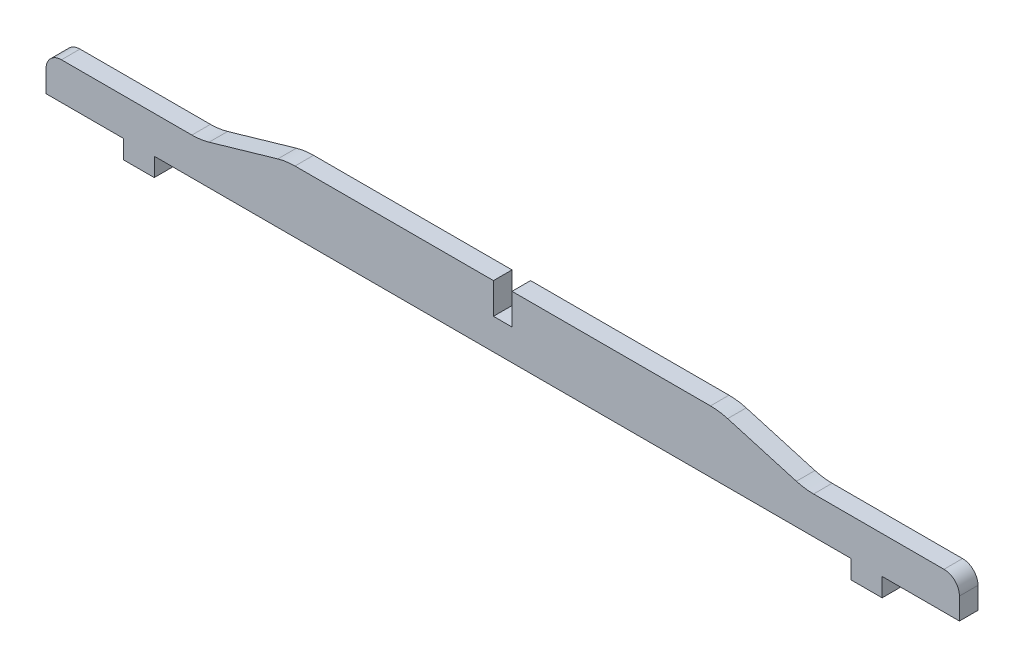
ISO-10303-21;
HEADER;
FILE_DESCRIPTION(('STEP AP214'),'2;1');
FILE_NAME('part.step','',(''),(''),'','','');
FILE_SCHEMA(('AUTOMOTIVE_DESIGN { 1 0 10303 214 1 1 1 1 }'));
ENDSEC;
DATA;
#1=APPLICATION_CONTEXT('core data for automotive mechanical design processes');
#2=APPLICATION_PROTOCOL_DEFINITION('international standard','automotive_design',2000,#1);
#3=PRODUCT_CONTEXT('',#1,'mechanical');
#4=PRODUCT('Part','Part','',(#3));
#5=PRODUCT_RELATED_PRODUCT_CATEGORY('part','',(#4));
#6=PRODUCT_DEFINITION_FORMATION('','',#4);
#7=PRODUCT_DEFINITION_CONTEXT('part definition',#1,'design');
#8=PRODUCT_DEFINITION('design','',#6,#7);
#9=PRODUCT_DEFINITION_SHAPE('','',#8);
#10=(LENGTH_UNIT() NAMED_UNIT(*) SI_UNIT(.MILLI.,.METRE.));
#11=(NAMED_UNIT(*) PLANE_ANGLE_UNIT() SI_UNIT($,.RADIAN.));
#12=(NAMED_UNIT(*) SI_UNIT($,.STERADIAN.) SOLID_ANGLE_UNIT());
#13=UNCERTAINTY_MEASURE_WITH_UNIT(LENGTH_MEASURE(1.E-05),#10,'distance_accuracy_value','');
#14=(GEOMETRIC_REPRESENTATION_CONTEXT(3) GLOBAL_UNCERTAINTY_ASSIGNED_CONTEXT((#13)) GLOBAL_UNIT_ASSIGNED_CONTEXT((#10,
#11,#12)) REPRESENTATION_CONTEXT('',''));
#15=CARTESIAN_POINT('',(0.,0.,0.));
#16=DIRECTION('',(0.,0.,1.));
#17=DIRECTION('',(1.,0.,0.));
#18=AXIS2_PLACEMENT_3D('',#15,#16,#17);
#19=CARTESIAN_POINT('',(70.,0.,6.));
#20=DIRECTION('',(0.,-1.,0.));
#21=DIRECTION('',(0.,0.,-1.));
#22=AXIS2_PLACEMENT_3D('',#19,#20,#21);
#23=PLANE('',#22);
#24=DIRECTION('',(-1.,0.,0.));
#25=VECTOR('',#24,1.);
#26=CARTESIAN_POINT('',(70.,0.,6.));
#27=LINE('',#26,#25);
#28=CARTESIAN_POINT('',(-3.,0.,6.));
#29=VERTEX_POINT('',#28);
#30=CARTESIAN_POINT('',(-67.1664737660185,0.,6.));
#31=VERTEX_POINT('',#30);
#32=EDGE_CURVE('E277',#29,#31,#27,.T.);
#33=ORIENTED_EDGE('',*,*,#32,.F.);
#34=DIRECTION('',(0.,0.,1.));
#35=VECTOR('',#34,1.);
#36=CARTESIAN_POINT('',(-3.,0.,0.));
#37=LINE('',#36,#35);
#38=CARTESIAN_POINT('',(-3.,0.,0.));
#39=VERTEX_POINT('',#38);
#40=EDGE_CURVE('E239',#39,#29,#37,.T.);
#41=ORIENTED_EDGE('',*,*,#40,.F.);
#42=DIRECTION('',(-1.,0.,0.));
#43=VECTOR('',#42,1.);
#44=CARTESIAN_POINT('',(70.,0.,0.));
#45=LINE('',#44,#43);
#46=CARTESIAN_POINT('',(-67.1664737660185,0.,0.));
#47=VERTEX_POINT('',#46);
#48=EDGE_CURVE('E233',#39,#47,#45,.T.);
#49=ORIENTED_EDGE('',*,*,#48,.T.);
#50=DIRECTION('',(0.,0.,-1.));
#51=VECTOR('',#50,1.);
#52=CARTESIAN_POINT('',(-67.1664737660185,0.,6.));
#53=LINE('',#52,#51);
#54=EDGE_CURVE('E442',#47,#31,#53,.F.);
#55=ORIENTED_EDGE('',*,*,#54,.T.);
#56=EDGE_LOOP('',(#33,#41,#49,#55));
#57=FACE_BOUND('',#56,.T.);
#58=ADVANCED_FACE('F38',(#57),#23,.F.);
#59=CARTESIAN_POINT('',(122.66666667,-26.,6.));
#60=DIRECTION('',(-1.,0.,0.));
#61=DIRECTION('',(0.,0.,1.));
#62=AXIS2_PLACEMENT_3D('',#59,#60,#61);
#63=PLANE('',#62);
#64=DIRECTION('',(0.,1.,0.));
#65=VECTOR('',#64,1.);
#66=CARTESIAN_POINT('',(122.66666667,-26.,0.));
#67=LINE('',#66,#65);
#68=CARTESIAN_POINT('',(122.66666667,-26.,0.));
#69=VERTEX_POINT('',#68);
#70=CARTESIAN_POINT('',(122.66666667,-20.,0.));
#71=VERTEX_POINT('',#70);
#72=EDGE_CURVE('E256',#69,#71,#67,.T.);
#73=ORIENTED_EDGE('',*,*,#72,.T.);
#74=DIRECTION('',(0.,0.,-1.));
#75=VECTOR('',#74,1.);
#76=CARTESIAN_POINT('',(122.66666667,-20.,6.));
#77=LINE('',#76,#75);
#78=CARTESIAN_POINT('',(122.66666667,-20.,6.));
#79=VERTEX_POINT('',#78);
#80=EDGE_CURVE('E400',#79,#71,#77,.T.);
#81=ORIENTED_EDGE('',*,*,#80,.F.);
#82=DIRECTION('',(0.,1.,0.));
#83=VECTOR('',#82,1.);
#84=CARTESIAN_POINT('',(122.66666667,-26.,6.));
#85=LINE('',#84,#83);
#86=CARTESIAN_POINT('',(122.66666667,-26.,6.));
#87=VERTEX_POINT('',#86);
#88=EDGE_CURVE('E257',#87,#79,#85,.T.);
#89=ORIENTED_EDGE('',*,*,#88,.F.);
#90=DIRECTION('',(0.,0.,-1.));
#91=VECTOR('',#90,1.);
#92=CARTESIAN_POINT('',(122.66666667,-26.,6.));
#93=LINE('',#92,#91);
#94=EDGE_CURVE('E312',#87,#69,#93,.T.);
#95=ORIENTED_EDGE('',*,*,#94,.T.);
#96=EDGE_LOOP('',(#73,#81,#89,#95));
#97=FACE_BOUND('',#96,.T.);
#98=ADVANCED_FACE('F540',(#97),#63,.F.);
#99=CARTESIAN_POINT('',(147.66666667,-20.,6.));
#100=DIRECTION('',(0.,1.,0.));
#101=DIRECTION('',(0.,0.,1.));
#102=AXIS2_PLACEMENT_3D('',#99,#100,#101);
#103=PLANE('',#102);
#104=DIRECTION('',(1.,0.,0.));
#105=VECTOR('',#104,1.);
#106=CARTESIAN_POINT('',(147.66666667,-20.,0.));
#107=LINE('',#106,#105);
#108=CARTESIAN_POINT('',(147.66666667,-20.,0.));
#109=VERTEX_POINT('',#108);
#110=EDGE_CURVE('E316',#71,#109,#107,.T.);
#111=ORIENTED_EDGE('',*,*,#110,.T.);
#112=DIRECTION('',(0.,0.,-1.));
#113=VECTOR('',#112,1.);
#114=CARTESIAN_POINT('',(147.66666667,-20.,6.));
#115=LINE('',#114,#113);
#116=CARTESIAN_POINT('',(147.66666667,-20.,6.));
#117=VERTEX_POINT('',#116);
#118=EDGE_CURVE('E396',#117,#109,#115,.T.);
#119=ORIENTED_EDGE('',*,*,#118,.F.);
#120=DIRECTION('',(1.,0.,0.));
#121=VECTOR('',#120,1.);
#122=CARTESIAN_POINT('',(147.66666667,-20.,6.));
#123=LINE('',#122,#121);
#124=EDGE_CURVE('E261',#79,#117,#123,.T.);
#125=ORIENTED_EDGE('',*,*,#124,.F.);
#126=ORIENTED_EDGE('',*,*,#80,.T.);
#127=EDGE_LOOP('',(#111,#119,#125,#126));
#128=FACE_BOUND('',#127,.T.);
#129=ADVANCED_FACE('F543',(#128),#103,.F.);
#130=CARTESIAN_POINT('',(147.66666667,-8.00000000000002,6.));
#131=DIRECTION('',(-1.,0.,0.));
#132=DIRECTION('',(0.,-1.,0.));
#133=AXIS2_PLACEMENT_3D('',#130,#131,#132);
#134=PLANE('',#133);
#135=DIRECTION('',(0.,1.,0.));
#136=VECTOR('',#135,1.);
#137=CARTESIAN_POINT('',(147.66666667,-8.00000000000002,0.));
#138=LINE('',#137,#136);
#139=CARTESIAN_POINT('',(147.66666667,-13.,0.));
#140=VERTEX_POINT('',#139);
#141=EDGE_CURVE('E319',#109,#140,#138,.T.);
#142=ORIENTED_EDGE('',*,*,#141,.T.);
#143=DIRECTION('',(0.,0.,-1.));
#144=VECTOR('',#143,1.);
#145=CARTESIAN_POINT('',(147.66666667,-13.,6.));
#146=LINE('',#145,#144);
#147=CARTESIAN_POINT('',(147.66666667,-13.,6.));
#148=VERTEX_POINT('',#147);
#149=EDGE_CURVE('E415',#140,#148,#146,.F.);
#150=ORIENTED_EDGE('',*,*,#149,.T.);
#151=DIRECTION('',(0.,1.,0.));
#152=VECTOR('',#151,1.);
#153=CARTESIAN_POINT('',(147.66666667,-8.00000000000002,6.));
#154=LINE('',#153,#152);
#155=EDGE_CURVE('E265',#117,#148,#154,.T.);
#156=ORIENTED_EDGE('',*,*,#155,.F.);
#157=ORIENTED_EDGE('',*,*,#118,.T.);
#158=EDGE_LOOP('',(#142,#150,#156,#157));
#159=FACE_BOUND('',#158,.T.);
#160=ADVANCED_FACE('F547',(#159),#134,.F.);
#161=CARTESIAN_POINT('',(97.66666667,-8.00000000000002,6.));
#162=DIRECTION('',(0.,-1.,0.));
#163=DIRECTION('',(1.,0.,0.));
#164=AXIS2_PLACEMENT_3D('',#161,#162,#163);
#165=PLANE('',#164);
#166=DIRECTION('',(-1.,0.,0.));
#167=VECTOR('',#166,1.);
#168=CARTESIAN_POINT('',(97.66666667,-8.00000000000002,0.));
#169=LINE('',#168,#167);
#170=CARTESIAN_POINT('',(142.66666667,-8.00000000000002,0.));
#171=VERTEX_POINT('',#170);
#172=CARTESIAN_POINT('',(100.500192903982,-8.00000000000002,0.));
#173=VERTEX_POINT('',#172);
#174=EDGE_CURVE('E323',#171,#173,#169,.T.);
#175=ORIENTED_EDGE('',*,*,#174,.T.);
#176=DIRECTION('',(0.,0.,-1.));
#177=VECTOR('',#176,1.);
#178=CARTESIAN_POINT('',(100.500192903982,-8.00000000000002,6.));
#179=LINE('',#178,#177);
#180=CARTESIAN_POINT('',(100.500192903982,-8.00000000000002,6.));
#181=VERTEX_POINT('',#180);
#182=EDGE_CURVE('E439',#173,#181,#179,.F.);
#183=ORIENTED_EDGE('',*,*,#182,.T.);
#184=DIRECTION('',(-1.,0.,0.));
#185=VECTOR('',#184,1.);
#186=CARTESIAN_POINT('',(97.66666667,-8.00000000000002,6.));
#187=LINE('',#186,#185);
#188=CARTESIAN_POINT('',(142.66666667,-8.00000000000002,6.));
#189=VERTEX_POINT('',#188);
#190=EDGE_CURVE('E269',#189,#181,#187,.T.);
#191=ORIENTED_EDGE('',*,*,#190,.F.);
#192=DIRECTION('',(0.,0.,-1.));
#193=VECTOR('',#192,1.);
#194=CARTESIAN_POINT('',(142.66666667,-8.00000000000002,6.));
#195=LINE('',#194,#193);
#196=EDGE_CURVE('E404',#189,#171,#195,.T.);
#197=ORIENTED_EDGE('',*,*,#196,.T.);
#198=EDGE_LOOP('',(#175,#183,#191,#197));
#199=FACE_BOUND('',#198,.T.);
#200=ADVANCED_FACE('F556',(#199),#165,.F.);
#201=CARTESIAN_POINT('',(70.,0.,6.));
#202=DIRECTION('',(-0.277777033532158,-0.960645574414453,0.));
#203=DIRECTION('',(0.960645574414453,-0.277777033532158,0.));
#204=AXIS2_PLACEMENT_3D('',#201,#202,#203);
#205=PLANE('',#204);
#206=DIRECTION('',(-0.960645574414453,0.277777033532158,0.));
#207=VECTOR('',#206,1.);
#208=CARTESIAN_POINT('',(70.,0.,6.));
#209=LINE('',#208,#207);
#210=CARTESIAN_POINT('',(94.9446522333384,-7.21291148828908,6.));
#211=VERTEX_POINT('',#210);
#212=CARTESIAN_POINT('',(72.7220144366616,-0.787088511710961,6.));
#213=VERTEX_POINT('',#212);
#214=EDGE_CURVE('E273',#211,#213,#209,.T.);
#215=ORIENTED_EDGE('',*,*,#214,.F.);
#216=DIRECTION('',(0.,0.,-1.));
#217=VECTOR('',#216,1.);
#218=CARTESIAN_POINT('',(94.9446522333384,-7.21291148828908,0.));
#219=LINE('',#218,#217);
#220=CARTESIAN_POINT('',(94.9446522333384,-7.21291148828908,0.));
#221=VERTEX_POINT('',#220);
#222=EDGE_CURVE('E435',#211,#221,#219,.T.);
#223=ORIENTED_EDGE('',*,*,#222,.T.);
#224=DIRECTION('',(-0.960645574414453,0.277777033532158,0.));
#225=VECTOR('',#224,1.);
#226=CARTESIAN_POINT('',(70.,0.,0.));
#227=LINE('',#226,#225);
#228=CARTESIAN_POINT('',(72.7220144366616,-0.787088511710961,0.));
#229=VERTEX_POINT('',#228);
#230=EDGE_CURVE('E327',#221,#229,#227,.T.);
#231=ORIENTED_EDGE('',*,*,#230,.T.);
#232=DIRECTION('',(0.,0.,-1.));
#233=VECTOR('',#232,1.);
#234=CARTESIAN_POINT('',(72.7220144366616,-0.787088511710961,6.));
#235=LINE('',#234,#233);
#236=EDGE_CURVE('E432',#229,#213,#235,.F.);
#237=ORIENTED_EDGE('',*,*,#236,.T.);
#238=EDGE_LOOP('',(#215,#223,#231,#237));
#239=FACE_BOUND('',#238,.T.);
#240=ADVANCED_FACE('F565',(#239),#205,.F.);
#241=CARTESIAN_POINT('',(67.1664737660185,0.,0.));
#242=VERTEX_POINT('',#241);
#243=CARTESIAN_POINT('',(3.,0.,0.));
#244=VERTEX_POINT('',#243);
#245=EDGE_CURVE('E331',#242,#244,#45,.T.);
#246=ORIENTED_EDGE('',*,*,#245,.T.);
#247=DIRECTION('',(0.,0.,1.));
#248=VECTOR('',#247,1.);
#249=CARTESIAN_POINT('',(3.,0.,0.));
#250=LINE('',#249,#248);
#251=CARTESIAN_POINT('',(3.,0.,6.));
#252=VERTEX_POINT('',#251);
#253=EDGE_CURVE('E243',#244,#252,#250,.T.);
#254=ORIENTED_EDGE('',*,*,#253,.T.);
#255=CARTESIAN_POINT('',(67.1664737660185,0.,6.));
#256=VERTEX_POINT('',#255);
#257=EDGE_CURVE('E278',#256,#252,#27,.T.);
#258=ORIENTED_EDGE('',*,*,#257,.F.);
#259=DIRECTION('',(0.,0.,-1.));
#260=VECTOR('',#259,1.);
#261=CARTESIAN_POINT('',(67.1664737660185,0.,6.));
#262=LINE('',#261,#260);
#263=EDGE_CURVE('E446',#256,#242,#262,.T.);
#264=ORIENTED_EDGE('',*,*,#263,.T.);
#265=EDGE_LOOP('',(#246,#254,#258,#264));
#266=FACE_BOUND('',#265,.T.);
#267=ADVANCED_FACE('F574',(#266),#23,.F.);
#268=CARTESIAN_POINT('',(-97.66666667,-8.00000000000002,6.));
#269=DIRECTION('',(0.277777033532158,-0.960645574414453,0.));
#270=DIRECTION('',(0.960645574414453,0.277777033532158,0.));
#271=AXIS2_PLACEMENT_3D('',#268,#269,#270);
#272=PLANE('',#271);
#273=DIRECTION('',(-0.960645574414453,-0.277777033532158,0.));
#274=VECTOR('',#273,1.);
#275=CARTESIAN_POINT('',(-97.66666667,-8.00000000000002,6.));
#276=LINE('',#275,#274);
#277=CARTESIAN_POINT('',(-72.7220144366616,-0.787088511710957,6.));
#278=VERTEX_POINT('',#277);
#279=CARTESIAN_POINT('',(-94.9446522333383,-7.21291148828908,6.));
#280=VERTEX_POINT('',#279);
#281=EDGE_CURVE('E282',#278,#280,#276,.T.);
#282=ORIENTED_EDGE('',*,*,#281,.F.);
#283=DIRECTION('',(0.,0.,-1.));
#284=VECTOR('',#283,1.);
#285=CARTESIAN_POINT('',(-72.7220144366616,-0.787088511710958,6.));
#286=LINE('',#285,#284);
#287=CARTESIAN_POINT('',(-72.7220144366616,-0.787088511710957,0.));
#288=VERTEX_POINT('',#287);
#289=EDGE_CURVE('E465',#278,#288,#286,.T.);
#290=ORIENTED_EDGE('',*,*,#289,.T.);
#291=DIRECTION('',(-0.960645574414453,-0.277777033532158,0.));
#292=VECTOR('',#291,1.);
#293=CARTESIAN_POINT('',(-97.66666667,-8.00000000000002,0.));
#294=LINE('',#293,#292);
#295=CARTESIAN_POINT('',(-94.9446522333383,-7.21291148828908,0.));
#296=VERTEX_POINT('',#295);
#297=EDGE_CURVE('E335',#288,#296,#294,.T.);
#298=ORIENTED_EDGE('',*,*,#297,.T.);
#299=DIRECTION('',(0.,0.,-1.));
#300=VECTOR('',#299,1.);
#301=CARTESIAN_POINT('',(-94.9446522333383,-7.21291148828908,6.));
#302=LINE('',#301,#300);
#303=EDGE_CURVE('E462',#296,#280,#302,.F.);
#304=ORIENTED_EDGE('',*,*,#303,.T.);
#305=EDGE_LOOP('',(#282,#290,#298,#304));
#306=FACE_BOUND('',#305,.T.);
#307=ADVANCED_FACE('F486',(#306),#272,.F.);
#308=CARTESIAN_POINT('',(-147.66666667,-8.00000000000002,6.));
#309=DIRECTION('',(0.,-1.,0.));
#310=DIRECTION('',(1.,0.,0.));
#311=AXIS2_PLACEMENT_3D('',#308,#309,#310);
#312=PLANE('',#311);
#313=DIRECTION('',(-1.,0.,0.));
#314=VECTOR('',#313,1.);
#315=CARTESIAN_POINT('',(-147.66666667,-8.00000000000002,6.));
#316=LINE('',#315,#314);
#317=CARTESIAN_POINT('',(-100.500192903981,-8.00000000000002,6.));
#318=VERTEX_POINT('',#317);
#319=CARTESIAN_POINT('',(-142.66666667,-8.00000000000002,6.));
#320=VERTEX_POINT('',#319);
#321=EDGE_CURVE('E285',#318,#320,#316,.T.);
#322=ORIENTED_EDGE('',*,*,#321,.F.);
#323=DIRECTION('',(0.,0.,-1.));
#324=VECTOR('',#323,1.);
#325=CARTESIAN_POINT('',(-100.500192903981,-8.00000000000003,0.));
#326=LINE('',#325,#324);
#327=CARTESIAN_POINT('',(-100.500192903981,-8.00000000000002,0.));
#328=VERTEX_POINT('',#327);
#329=EDGE_CURVE('E469',#318,#328,#326,.T.);
#330=ORIENTED_EDGE('',*,*,#329,.T.);
#331=DIRECTION('',(-1.,0.,0.));
#332=VECTOR('',#331,1.);
#333=CARTESIAN_POINT('',(-147.66666667,-8.00000000000002,0.));
#334=LINE('',#333,#332);
#335=CARTESIAN_POINT('',(-142.66666667,-8.00000000000002,0.));
#336=VERTEX_POINT('',#335);
#337=EDGE_CURVE('E339',#328,#336,#334,.T.);
#338=ORIENTED_EDGE('',*,*,#337,.T.);
#339=DIRECTION('',(0.,0.,-1.));
#340=VECTOR('',#339,1.);
#341=CARTESIAN_POINT('',(-142.66666667,-8.00000000000002,6.));
#342=LINE('',#341,#340);
#343=EDGE_CURVE('E428',#336,#320,#342,.F.);
#344=ORIENTED_EDGE('',*,*,#343,.T.);
#345=EDGE_LOOP('',(#322,#330,#338,#344));
#346=FACE_BOUND('',#345,.T.);
#347=ADVANCED_FACE('F489',(#346),#312,.F.);
#348=CARTESIAN_POINT('',(-147.66666667,-20.,6.));
#349=DIRECTION('',(1.,0.,0.));
#350=DIRECTION('',(0.,1.,0.));
#351=AXIS2_PLACEMENT_3D('',#348,#349,#350);
#352=PLANE('',#351);
#353=DIRECTION('',(0.,-1.,0.));
#354=VECTOR('',#353,1.);
#355=CARTESIAN_POINT('',(-147.66666667,-20.,6.));
#356=LINE('',#355,#354);
#357=CARTESIAN_POINT('',(-147.66666667,-13.,6.));
#358=VERTEX_POINT('',#357);
#359=CARTESIAN_POINT('',(-147.66666667,-20.,6.));
#360=VERTEX_POINT('',#359);
#361=EDGE_CURVE('E288',#358,#360,#356,.T.);
#362=ORIENTED_EDGE('',*,*,#361,.F.);
#363=DIRECTION('',(0.,0.,-1.));
#364=VECTOR('',#363,1.);
#365=CARTESIAN_POINT('',(-147.66666667,-13.,6.));
#366=LINE('',#365,#364);
#367=CARTESIAN_POINT('',(-147.66666667,-13.,0.));
#368=VERTEX_POINT('',#367);
#369=EDGE_CURVE('E424',#358,#368,#366,.T.);
#370=ORIENTED_EDGE('',*,*,#369,.T.);
#371=DIRECTION('',(0.,-1.,0.));
#372=VECTOR('',#371,1.);
#373=CARTESIAN_POINT('',(-147.66666667,-20.,0.));
#374=LINE('',#373,#372);
#375=CARTESIAN_POINT('',(-147.66666667,-20.,0.));
#376=VERTEX_POINT('',#375);
#377=EDGE_CURVE('E342',#368,#376,#374,.T.);
#378=ORIENTED_EDGE('',*,*,#377,.T.);
#379=DIRECTION('',(0.,0.,-1.));
#380=VECTOR('',#379,1.);
#381=CARTESIAN_POINT('',(-147.66666667,-20.,6.));
#382=LINE('',#381,#380);
#383=EDGE_CURVE('E392',#360,#376,#382,.T.);
#384=ORIENTED_EDGE('',*,*,#383,.F.);
#385=EDGE_LOOP('',(#362,#370,#378,#384));
#386=FACE_BOUND('',#385,.T.);
#387=ADVANCED_FACE('F498',(#386),#352,.F.);
#388=CARTESIAN_POINT('',(-147.66666667,-20.,6.));
#389=DIRECTION('',(0.,1.,0.));
#390=DIRECTION('',(0.,0.,1.));
#391=AXIS2_PLACEMENT_3D('',#388,#389,#390);
#392=PLANE('',#391);
#393=DIRECTION('',(1.,0.,0.));
#394=VECTOR('',#393,1.);
#395=CARTESIAN_POINT('',(-147.66666667,-20.,0.));
#396=LINE('',#395,#394);
#397=CARTESIAN_POINT('',(-122.66666667,-20.,0.));
#398=VERTEX_POINT('',#397);
#399=EDGE_CURVE('E345',#376,#398,#396,.T.);
#400=ORIENTED_EDGE('',*,*,#399,.T.);
#401=DIRECTION('',(0.,0.,-1.));
#402=VECTOR('',#401,1.);
#403=CARTESIAN_POINT('',(-122.66666667,-20.,6.));
#404=LINE('',#403,#402);
#405=CARTESIAN_POINT('',(-122.66666667,-20.,6.));
#406=VERTEX_POINT('',#405);
#407=EDGE_CURVE('E388',#406,#398,#404,.T.);
#408=ORIENTED_EDGE('',*,*,#407,.F.);
#409=DIRECTION('',(1.,0.,0.));
#410=VECTOR('',#409,1.);
#411=CARTESIAN_POINT('',(-147.66666667,-20.,6.));
#412=LINE('',#411,#410);
#413=EDGE_CURVE('E291',#360,#406,#412,.T.);
#414=ORIENTED_EDGE('',*,*,#413,.F.);
#415=ORIENTED_EDGE('',*,*,#383,.T.);
#416=EDGE_LOOP('',(#400,#408,#414,#415));
#417=FACE_BOUND('',#416,.T.);
#418=ADVANCED_FACE('F505',(#417),#392,.F.);
#419=CARTESIAN_POINT('',(-122.66666667,-20.,6.));
#420=DIRECTION('',(1.,0.,0.));
#421=DIRECTION('',(0.,0.,-1.));
#422=AXIS2_PLACEMENT_3D('',#419,#420,#421);
#423=PLANE('',#422);
#424=DIRECTION('',(0.,-1.,0.));
#425=VECTOR('',#424,1.);
#426=CARTESIAN_POINT('',(-122.66666667,-20.,0.));
#427=LINE('',#426,#425);
#428=CARTESIAN_POINT('',(-122.66666667,-26.,0.));
#429=VERTEX_POINT('',#428);
#430=EDGE_CURVE('E348',#398,#429,#427,.T.);
#431=ORIENTED_EDGE('',*,*,#430,.T.);
#432=DIRECTION('',(0.,0.,-1.));
#433=VECTOR('',#432,1.);
#434=CARTESIAN_POINT('',(-122.66666667,-26.,6.));
#435=LINE('',#434,#433);
#436=CARTESIAN_POINT('',(-122.66666667,-26.,6.));
#437=VERTEX_POINT('',#436);
#438=EDGE_CURVE('E384',#437,#429,#435,.T.);
#439=ORIENTED_EDGE('',*,*,#438,.F.);
#440=DIRECTION('',(0.,-1.,0.));
#441=VECTOR('',#440,1.);
#442=CARTESIAN_POINT('',(-122.66666667,-20.,6.));
#443=LINE('',#442,#441);
#444=EDGE_CURVE('E294',#406,#437,#443,.T.);
#445=ORIENTED_EDGE('',*,*,#444,.F.);
#446=ORIENTED_EDGE('',*,*,#407,.T.);
#447=EDGE_LOOP('',(#431,#439,#445,#446));
#448=FACE_BOUND('',#447,.T.);
#449=ADVANCED_FACE('F512',(#448),#423,.F.);
#450=CARTESIAN_POINT('',(-122.66666667,-26.,6.));
#451=DIRECTION('',(0.,1.,0.));
#452=DIRECTION('',(0.,0.,1.));
#453=AXIS2_PLACEMENT_3D('',#450,#451,#452);
#454=PLANE('',#453);
#455=DIRECTION('',(1.,0.,0.));
#456=VECTOR('',#455,1.);
#457=CARTESIAN_POINT('',(-122.66666667,-26.,0.));
#458=LINE('',#457,#456);
#459=CARTESIAN_POINT('',(-112.66666667,-26.,0.));
#460=VERTEX_POINT('',#459);
#461=EDGE_CURVE('E351',#429,#460,#458,.T.);
#462=ORIENTED_EDGE('',*,*,#461,.T.);
#463=DIRECTION('',(0.,0.,-1.));
#464=VECTOR('',#463,1.);
#465=CARTESIAN_POINT('',(-112.66666667,-26.,6.));
#466=LINE('',#465,#464);
#467=CARTESIAN_POINT('',(-112.66666667,-26.,6.));
#468=VERTEX_POINT('',#467);
#469=EDGE_CURVE('E380',#468,#460,#466,.T.);
#470=ORIENTED_EDGE('',*,*,#469,.F.);
#471=DIRECTION('',(1.,0.,0.));
#472=VECTOR('',#471,1.);
#473=CARTESIAN_POINT('',(-122.66666667,-26.,6.));
#474=LINE('',#473,#472);
#475=EDGE_CURVE('E297',#437,#468,#474,.T.);
#476=ORIENTED_EDGE('',*,*,#475,.F.);
#477=ORIENTED_EDGE('',*,*,#438,.T.);
#478=EDGE_LOOP('',(#462,#470,#476,#477));
#479=FACE_BOUND('',#478,.T.);
#480=ADVANCED_FACE('F515',(#479),#454,.F.);
#481=CARTESIAN_POINT('',(-112.66666667,-26.,6.));
#482=DIRECTION('',(-1.,0.,0.));
#483=DIRECTION('',(0.,0.,1.));
#484=AXIS2_PLACEMENT_3D('',#481,#482,#483);
#485=PLANE('',#484);
#486=DIRECTION('',(0.,1.,0.));
#487=VECTOR('',#486,1.);
#488=CARTESIAN_POINT('',(-112.66666667,-26.,0.));
#489=LINE('',#488,#487);
#490=CARTESIAN_POINT('',(-112.66666667,-20.,0.));
#491=VERTEX_POINT('',#490);
#492=EDGE_CURVE('E354',#460,#491,#489,.T.);
#493=ORIENTED_EDGE('',*,*,#492,.T.);
#494=DIRECTION('',(0.,0.,-1.));
#495=VECTOR('',#494,1.);
#496=CARTESIAN_POINT('',(-112.66666667,-20.,6.));
#497=LINE('',#496,#495);
#498=CARTESIAN_POINT('',(-112.66666667,-20.,6.));
#499=VERTEX_POINT('',#498);
#500=EDGE_CURVE('E376',#499,#491,#497,.T.);
#501=ORIENTED_EDGE('',*,*,#500,.F.);
#502=DIRECTION('',(0.,1.,0.));
#503=VECTOR('',#502,1.);
#504=CARTESIAN_POINT('',(-112.66666667,-26.,6.));
#505=LINE('',#504,#503);
#506=EDGE_CURVE('E300',#468,#499,#505,.T.);
#507=ORIENTED_EDGE('',*,*,#506,.F.);
#508=ORIENTED_EDGE('',*,*,#469,.T.);
#509=EDGE_LOOP('',(#493,#501,#507,#508));
#510=FACE_BOUND('',#509,.T.);
#511=ADVANCED_FACE('F520',(#510),#485,.F.);
#512=CARTESIAN_POINT('',(112.66666667,-20.,6.));
#513=DIRECTION('',(0.,1.,0.));
#514=DIRECTION('',(0.,0.,1.));
#515=AXIS2_PLACEMENT_3D('',#512,#513,#514);
#516=PLANE('',#515);
#517=DIRECTION('',(1.,0.,0.));
#518=VECTOR('',#517,1.);
#519=CARTESIAN_POINT('',(112.66666667,-20.,0.));
#520=LINE('',#519,#518);
#521=CARTESIAN_POINT('',(112.66666667,-20.,0.));
#522=VERTEX_POINT('',#521);
#523=EDGE_CURVE('E357',#491,#522,#520,.T.);
#524=ORIENTED_EDGE('',*,*,#523,.T.);
#525=DIRECTION('',(0.,0.,-1.));
#526=VECTOR('',#525,1.);
#527=CARTESIAN_POINT('',(112.66666667,-20.,6.));
#528=LINE('',#527,#526);
#529=CARTESIAN_POINT('',(112.66666667,-20.,6.));
#530=VERTEX_POINT('',#529);
#531=EDGE_CURVE('E372',#530,#522,#528,.T.);
#532=ORIENTED_EDGE('',*,*,#531,.F.);
#533=DIRECTION('',(1.,0.,0.));
#534=VECTOR('',#533,1.);
#535=CARTESIAN_POINT('',(112.66666667,-20.,6.));
#536=LINE('',#535,#534);
#537=EDGE_CURVE('E303',#499,#530,#536,.T.);
#538=ORIENTED_EDGE('',*,*,#537,.F.);
#539=ORIENTED_EDGE('',*,*,#500,.T.);
#540=EDGE_LOOP('',(#524,#532,#538,#539));
#541=FACE_BOUND('',#540,.T.);
#542=ADVANCED_FACE('F526',(#541),#516,.F.);
#543=CARTESIAN_POINT('',(112.66666667,-20.,6.));
#544=DIRECTION('',(1.,0.,0.));
#545=DIRECTION('',(0.,0.,-1.));
#546=AXIS2_PLACEMENT_3D('',#543,#544,#545);
#547=PLANE('',#546);
#548=DIRECTION('',(0.,-1.,0.));
#549=VECTOR('',#548,1.);
#550=CARTESIAN_POINT('',(112.66666667,-20.,0.));
#551=LINE('',#550,#549);
#552=CARTESIAN_POINT('',(112.66666667,-26.,0.));
#553=VERTEX_POINT('',#552);
#554=EDGE_CURVE('E360',#522,#553,#551,.T.);
#555=ORIENTED_EDGE('',*,*,#554,.T.);
#556=DIRECTION('',(0.,0.,-1.));
#557=VECTOR('',#556,1.);
#558=CARTESIAN_POINT('',(112.66666667,-26.,6.));
#559=LINE('',#558,#557);
#560=CARTESIAN_POINT('',(112.66666667,-26.,6.));
#561=VERTEX_POINT('',#560);
#562=EDGE_CURVE('E368',#561,#553,#559,.T.);
#563=ORIENTED_EDGE('',*,*,#562,.F.);
#564=DIRECTION('',(0.,-1.,0.));
#565=VECTOR('',#564,1.);
#566=CARTESIAN_POINT('',(112.66666667,-20.,6.));
#567=LINE('',#566,#565);
#568=EDGE_CURVE('E306',#530,#561,#567,.T.);
#569=ORIENTED_EDGE('',*,*,#568,.F.);
#570=ORIENTED_EDGE('',*,*,#531,.T.);
#571=EDGE_LOOP('',(#555,#563,#569,#570));
#572=FACE_BOUND('',#571,.T.);
#573=ADVANCED_FACE('F530',(#572),#547,.F.);
#574=CARTESIAN_POINT('',(112.66666667,-26.,6.));
#575=DIRECTION('',(0.,1.,0.));
#576=DIRECTION('',(0.,0.,1.));
#577=AXIS2_PLACEMENT_3D('',#574,#575,#576);
#578=PLANE('',#577);
#579=DIRECTION('',(1.,0.,0.));
#580=VECTOR('',#579,1.);
#581=CARTESIAN_POINT('',(112.66666667,-26.,0.));
#582=LINE('',#581,#580);
#583=EDGE_CURVE('E262',#553,#69,#582,.T.);
#584=ORIENTED_EDGE('',*,*,#583,.T.);
#585=ORIENTED_EDGE('',*,*,#94,.F.);
#586=DIRECTION('',(1.,0.,0.));
#587=VECTOR('',#586,1.);
#588=CARTESIAN_POINT('',(112.66666667,-26.,6.));
#589=LINE('',#588,#587);
#590=EDGE_CURVE('E309',#561,#87,#589,.T.);
#591=ORIENTED_EDGE('',*,*,#590,.F.);
#592=ORIENTED_EDGE('',*,*,#562,.T.);
#593=EDGE_LOOP('',(#584,#585,#591,#592));
#594=FACE_BOUND('',#593,.T.);
#595=ADVANCED_FACE('F535',(#594),#578,.F.);
#596=CARTESIAN_POINT('',(0.,0.,6.));
#597=DIRECTION('',(0.,0.,1.));
#598=DIRECTION('',(1.,0.,0.));
#599=AXIS2_PLACEMENT_3D('',#596,#597,#598);
#600=PLANE('',#599);
#601=DIRECTION('',(0.,-1.,0.));
#602=VECTOR('',#601,1.);
#603=CARTESIAN_POINT('',(-3.,0.,6.));
#604=LINE('',#603,#602);
#605=CARTESIAN_POINT('',(-3.,-10.,6.));
#606=VERTEX_POINT('',#605);
#607=EDGE_CURVE('E218',#29,#606,#604,.T.);
#608=ORIENTED_EDGE('',*,*,#607,.F.);
#609=ORIENTED_EDGE('',*,*,#32,.T.);
#610=CARTESIAN_POINT('',(-67.1664737660185,-20.,6.));
#611=DIRECTION('',(0.,0.,1.));
#612=DIRECTION('',(1.,0.,0.));
#613=AXIS2_PLACEMENT_3D('',#610,#611,#612);
#614=CIRCLE('',#613,20.);
#615=EDGE_CURVE('E456',#31,#278,#614,.T.);
#616=ORIENTED_EDGE('',*,*,#615,.T.);
#617=ORIENTED_EDGE('',*,*,#281,.T.);
#618=CARTESIAN_POINT('',(-100.500192903981,12.,6.));
#619=DIRECTION('',(0.,0.,1.));
#620=DIRECTION('',(1.,0.,0.));
#621=AXIS2_PLACEMENT_3D('',#618,#619,#620);
#622=CIRCLE('',#621,20.);
#623=EDGE_CURVE('E11',#280,#318,#622,.F.);
#624=ORIENTED_EDGE('',*,*,#623,.T.);
#625=ORIENTED_EDGE('',*,*,#321,.T.);
#626=CARTESIAN_POINT('',(-142.66666667,-13.,6.));
#627=DIRECTION('',(0.,0.,1.));
#628=DIRECTION('',(1.,0.,0.));
#629=AXIS2_PLACEMENT_3D('',#626,#627,#628);
#630=CIRCLE('',#629,5.);
#631=EDGE_CURVE('E418',#320,#358,#630,.T.);
#632=ORIENTED_EDGE('',*,*,#631,.T.);
#633=ORIENTED_EDGE('',*,*,#361,.T.);
#634=ORIENTED_EDGE('',*,*,#413,.T.);
#635=ORIENTED_EDGE('',*,*,#444,.T.);
#636=ORIENTED_EDGE('',*,*,#475,.T.);
#637=ORIENTED_EDGE('',*,*,#506,.T.);
#638=ORIENTED_EDGE('',*,*,#537,.T.);
#639=ORIENTED_EDGE('',*,*,#568,.T.);
#640=ORIENTED_EDGE('',*,*,#590,.T.);
#641=ORIENTED_EDGE('',*,*,#88,.T.);
#642=ORIENTED_EDGE('',*,*,#124,.T.);
#643=ORIENTED_EDGE('',*,*,#155,.T.);
#644=CARTESIAN_POINT('',(142.66666667,-13.,6.));
#645=DIRECTION('',(0.,0.,1.));
#646=DIRECTION('',(1.,0.,0.));
#647=AXIS2_PLACEMENT_3D('',#644,#645,#646);
#648=CIRCLE('',#647,5.);
#649=EDGE_CURVE('E421',#148,#189,#648,.T.);
#650=ORIENTED_EDGE('',*,*,#649,.T.);
#651=ORIENTED_EDGE('',*,*,#190,.T.);
#652=CARTESIAN_POINT('',(100.500192903982,12.,6.));
#653=DIRECTION('',(0.,0.,1.));
#654=DIRECTION('',(1.,0.,0.));
#655=AXIS2_PLACEMENT_3D('',#652,#653,#654);
#656=CIRCLE('',#655,20.);
#657=EDGE_CURVE('E476',#181,#211,#656,.F.);
#658=ORIENTED_EDGE('',*,*,#657,.T.);
#659=ORIENTED_EDGE('',*,*,#214,.T.);
#660=CARTESIAN_POINT('',(67.1664737660185,-20.,6.));
#661=DIRECTION('',(0.,0.,1.));
#662=DIRECTION('',(1.,0.,0.));
#663=AXIS2_PLACEMENT_3D('',#660,#661,#662);
#664=CIRCLE('',#663,20.);
#665=EDGE_CURVE('E459',#213,#256,#664,.T.);
#666=ORIENTED_EDGE('',*,*,#665,.T.);
#667=ORIENTED_EDGE('',*,*,#257,.T.);
#668=DIRECTION('',(0.,1.,0.));
#669=VECTOR('',#668,1.);
#670=CARTESIAN_POINT('',(3.,0.,6.));
#671=LINE('',#670,#669);
#672=CARTESIAN_POINT('',(3.,-10.,6.));
#673=VERTEX_POINT('',#672);
#674=EDGE_CURVE('E251',#673,#252,#671,.T.);
#675=ORIENTED_EDGE('',*,*,#674,.F.);
#676=DIRECTION('',(1.,0.,0.));
#677=VECTOR('',#676,1.);
#678=CARTESIAN_POINT('',(0.,-10.,6.));
#679=LINE('',#678,#677);
#680=EDGE_CURVE('E242',#606,#673,#679,.T.);
#681=ORIENTED_EDGE('',*,*,#680,.F.);
#682=EDGE_LOOP('',(#608,#609,#616,#617,#624,#625,#632,#633,#634,#635,#636,#637,#638,#639,#640,
#641,#642,#643,#650,#651,#658,#659,#666,#667,#675,#681));
#683=FACE_BOUND('',#682,.T.);
#684=ADVANCED_FACE('F492',(#683),#600,.T.);
#685=CARTESIAN_POINT('',(0.,0.,0.));
#686=DIRECTION('',(0.,0.,1.));
#687=DIRECTION('',(1.,0.,0.));
#688=AXIS2_PLACEMENT_3D('',#685,#686,#687);
#689=PLANE('',#688);
#690=ORIENTED_EDGE('',*,*,#48,.F.);
#691=DIRECTION('',(0.,-1.,0.));
#692=VECTOR('',#691,1.);
#693=CARTESIAN_POINT('',(-3.,-10.,0.));
#694=LINE('',#693,#692);
#695=CARTESIAN_POINT('',(-3.,-10.,0.));
#696=VERTEX_POINT('',#695);
#697=EDGE_CURVE('E215',#39,#696,#694,.T.);
#698=ORIENTED_EDGE('',*,*,#697,.T.);
#699=DIRECTION('',(1.,0.,0.));
#700=VECTOR('',#699,1.);
#701=CARTESIAN_POINT('',(-3.,-10.,0.));
#702=LINE('',#701,#700);
#703=CARTESIAN_POINT('',(3.,-10.,0.));
#704=VERTEX_POINT('',#703);
#705=EDGE_CURVE('E225',#696,#704,#702,.T.);
#706=ORIENTED_EDGE('',*,*,#705,.T.);
#707=DIRECTION('',(0.,1.,0.));
#708=VECTOR('',#707,1.);
#709=CARTESIAN_POINT('',(3.,-10.,0.));
#710=LINE('',#709,#708);
#711=EDGE_CURVE('E54',#704,#244,#710,.T.);
#712=ORIENTED_EDGE('',*,*,#711,.T.);
#713=ORIENTED_EDGE('',*,*,#245,.F.);
#714=CARTESIAN_POINT('',(67.1664737660185,-20.,0.));
#715=DIRECTION('',(0.,0.,1.));
#716=DIRECTION('',(1.,0.,0.));
#717=AXIS2_PLACEMENT_3D('',#714,#715,#716);
#718=CIRCLE('',#717,20.);
#719=EDGE_CURVE('E453',#242,#229,#718,.F.);
#720=ORIENTED_EDGE('',*,*,#719,.T.);
#721=ORIENTED_EDGE('',*,*,#230,.F.);
#722=CARTESIAN_POINT('',(100.500192903982,12.,0.));
#723=DIRECTION('',(0.,0.,1.));
#724=DIRECTION('',(1.,0.,0.));
#725=AXIS2_PLACEMENT_3D('',#722,#723,#724);
#726=CIRCLE('',#725,20.);
#727=EDGE_CURVE('E473',#221,#173,#726,.T.);
#728=ORIENTED_EDGE('',*,*,#727,.T.);
#729=ORIENTED_EDGE('',*,*,#174,.F.);
#730=CARTESIAN_POINT('',(142.66666667,-13.,0.));
#731=DIRECTION('',(0.,0.,1.));
#732=DIRECTION('',(1.,0.,0.));
#733=AXIS2_PLACEMENT_3D('',#730,#731,#732);
#734=CIRCLE('',#733,5.);
#735=EDGE_CURVE('E412',#171,#140,#734,.F.);
#736=ORIENTED_EDGE('',*,*,#735,.T.);
#737=ORIENTED_EDGE('',*,*,#141,.F.);
#738=ORIENTED_EDGE('',*,*,#110,.F.);
#739=ORIENTED_EDGE('',*,*,#72,.F.);
#740=ORIENTED_EDGE('',*,*,#583,.F.);
#741=ORIENTED_EDGE('',*,*,#554,.F.);
#742=ORIENTED_EDGE('',*,*,#523,.F.);
#743=ORIENTED_EDGE('',*,*,#492,.F.);
#744=ORIENTED_EDGE('',*,*,#461,.F.);
#745=ORIENTED_EDGE('',*,*,#430,.F.);
#746=ORIENTED_EDGE('',*,*,#399,.F.);
#747=ORIENTED_EDGE('',*,*,#377,.F.);
#748=CARTESIAN_POINT('',(-142.66666667,-13.,0.));
#749=DIRECTION('',(0.,0.,1.));
#750=DIRECTION('',(1.,0.,0.));
#751=AXIS2_PLACEMENT_3D('',#748,#749,#750);
#752=CIRCLE('',#751,5.);
#753=EDGE_CURVE('E408',#368,#336,#752,.F.);
#754=ORIENTED_EDGE('',*,*,#753,.T.);
#755=ORIENTED_EDGE('',*,*,#337,.F.);
#756=CARTESIAN_POINT('',(-100.500192903981,12.,0.));
#757=DIRECTION('',(0.,0.,1.));
#758=DIRECTION('',(1.,0.,0.));
#759=AXIS2_PLACEMENT_3D('',#756,#757,#758);
#760=CIRCLE('',#759,20.);
#761=EDGE_CURVE('E47',#328,#296,#760,.T.);
#762=ORIENTED_EDGE('',*,*,#761,.T.);
#763=ORIENTED_EDGE('',*,*,#297,.F.);
#764=CARTESIAN_POINT('',(-67.1664737660185,-20.,0.));
#765=DIRECTION('',(0.,0.,1.));
#766=DIRECTION('',(1.,0.,0.));
#767=AXIS2_PLACEMENT_3D('',#764,#765,#766);
#768=CIRCLE('',#767,20.);
#769=EDGE_CURVE('E450',#288,#47,#768,.F.);
#770=ORIENTED_EDGE('',*,*,#769,.T.);
#771=EDGE_LOOP('',(#690,#698,#706,#712,#713,#720,#721,#728,#729,#736,#737,#738,#739,#740,#741,
#742,#743,#744,#745,#746,#747,#754,#755,#762,#763,#770));
#772=FACE_BOUND('',#771,.T.);
#773=ADVANCED_FACE('F231',(#772),#689,.F.);
#774=CARTESIAN_POINT('',(142.66666667,-13.,6.));
#775=DIRECTION('',(0.,0.,-1.));
#776=DIRECTION('',(-1.,0.,0.));
#777=AXIS2_PLACEMENT_3D('',#774,#775,#776);
#778=CYLINDRICAL_SURFACE('',#777,5.);
#779=ORIENTED_EDGE('',*,*,#649,.F.);
#780=ORIENTED_EDGE('',*,*,#149,.F.);
#781=ORIENTED_EDGE('',*,*,#735,.F.);
#782=ORIENTED_EDGE('',*,*,#196,.F.);
#783=EDGE_LOOP('',(#779,#780,#781,#782));
#784=FACE_BOUND('',#783,.T.);
#785=ADVANCED_FACE('F553',(#784),#778,.T.);
#786=CARTESIAN_POINT('',(-142.66666667,-13.,6.));
#787=DIRECTION('',(0.,0.,-1.));
#788=DIRECTION('',(-1.,0.,0.));
#789=AXIS2_PLACEMENT_3D('',#786,#787,#788);
#790=CYLINDRICAL_SURFACE('',#789,5.);
#791=ORIENTED_EDGE('',*,*,#631,.F.);
#792=ORIENTED_EDGE('',*,*,#343,.F.);
#793=ORIENTED_EDGE('',*,*,#753,.F.);
#794=ORIENTED_EDGE('',*,*,#369,.F.);
#795=EDGE_LOOP('',(#791,#792,#793,#794));
#796=FACE_BOUND('',#795,.T.);
#797=ADVANCED_FACE('F501',(#796),#790,.T.);
#798=CARTESIAN_POINT('',(100.500192903982,12.,6.));
#799=DIRECTION('',(0.,0.,1.));
#800=DIRECTION('',(1.,0.,0.));
#801=AXIS2_PLACEMENT_3D('',#798,#799,#800);
#802=CYLINDRICAL_SURFACE('',#801,20.);
#803=ORIENTED_EDGE('',*,*,#657,.F.);
#804=ORIENTED_EDGE('',*,*,#182,.F.);
#805=ORIENTED_EDGE('',*,*,#727,.F.);
#806=ORIENTED_EDGE('',*,*,#222,.F.);
#807=EDGE_LOOP('',(#803,#804,#805,#806));
#808=FACE_BOUND('',#807,.T.);
#809=ADVANCED_FACE('F562',(#808),#802,.F.);
#810=CARTESIAN_POINT('',(67.1664737660185,-20.,6.));
#811=DIRECTION('',(0.,0.,-1.));
#812=DIRECTION('',(-1.,0.,0.));
#813=AXIS2_PLACEMENT_3D('',#810,#811,#812);
#814=CYLINDRICAL_SURFACE('',#813,20.);
#815=ORIENTED_EDGE('',*,*,#665,.F.);
#816=ORIENTED_EDGE('',*,*,#236,.F.);
#817=ORIENTED_EDGE('',*,*,#719,.F.);
#818=ORIENTED_EDGE('',*,*,#263,.F.);
#819=EDGE_LOOP('',(#815,#816,#817,#818));
#820=FACE_BOUND('',#819,.T.);
#821=ADVANCED_FACE('F571',(#820),#814,.T.);
#822=CARTESIAN_POINT('',(-67.1664737660185,-20.,6.));
#823=DIRECTION('',(0.,0.,-1.));
#824=DIRECTION('',(-1.,0.,0.));
#825=AXIS2_PLACEMENT_3D('',#822,#823,#824);
#826=CYLINDRICAL_SURFACE('',#825,20.);
#827=ORIENTED_EDGE('',*,*,#615,.F.);
#828=ORIENTED_EDGE('',*,*,#54,.F.);
#829=ORIENTED_EDGE('',*,*,#769,.F.);
#830=ORIENTED_EDGE('',*,*,#289,.F.);
#831=EDGE_LOOP('',(#827,#828,#829,#830));
#832=FACE_BOUND('',#831,.T.);
#833=ADVANCED_FACE('F618',(#832),#826,.T.);
#834=CARTESIAN_POINT('',(-100.500192903981,12.,6.));
#835=DIRECTION('',(0.,0.,1.));
#836=DIRECTION('',(1.,0.,0.));
#837=AXIS2_PLACEMENT_3D('',#834,#835,#836);
#838=CYLINDRICAL_SURFACE('',#837,20.);
#839=ORIENTED_EDGE('',*,*,#623,.F.);
#840=ORIENTED_EDGE('',*,*,#303,.F.);
#841=ORIENTED_EDGE('',*,*,#761,.F.);
#842=ORIENTED_EDGE('',*,*,#329,.F.);
#843=EDGE_LOOP('',(#839,#840,#841,#842));
#844=FACE_BOUND('',#843,.T.);
#845=ADVANCED_FACE('F40',(#844),#838,.F.);
#846=CARTESIAN_POINT('',(-3.,-10.,0.));
#847=DIRECTION('',(-1.,0.,0.));
#848=DIRECTION('',(0.,0.,1.));
#849=AXIS2_PLACEMENT_3D('',#846,#847,#848);
#850=PLANE('',#849);
#851=ORIENTED_EDGE('',*,*,#607,.T.);
#852=DIRECTION('',(0.,0.,1.));
#853=VECTOR('',#852,1.);
#854=CARTESIAN_POINT('',(-3.,-10.,0.));
#855=LINE('',#854,#853);
#856=EDGE_CURVE('E211',#696,#606,#855,.T.);
#857=ORIENTED_EDGE('',*,*,#856,.F.);
#858=ORIENTED_EDGE('',*,*,#697,.F.);
#859=ORIENTED_EDGE('',*,*,#40,.T.);
#860=EDGE_LOOP('',(#851,#857,#858,#859));
#861=FACE_BOUND('',#860,.T.);
#862=ADVANCED_FACE('F213',(#861),#850,.F.);
#863=CARTESIAN_POINT('',(3.,-10.,0.));
#864=DIRECTION('',(1.,0.,0.));
#865=DIRECTION('',(0.,1.,0.));
#866=AXIS2_PLACEMENT_3D('',#863,#864,#865);
#867=PLANE('',#866);
#868=ORIENTED_EDGE('',*,*,#674,.T.);
#869=ORIENTED_EDGE('',*,*,#253,.F.);
#870=ORIENTED_EDGE('',*,*,#711,.F.);
#871=DIRECTION('',(0.,0.,1.));
#872=VECTOR('',#871,1.);
#873=CARTESIAN_POINT('',(3.,-10.,0.));
#874=LINE('',#873,#872);
#875=EDGE_CURVE('E222',#704,#673,#874,.T.);
#876=ORIENTED_EDGE('',*,*,#875,.T.);
#877=EDGE_LOOP('',(#868,#869,#870,#876));
#878=FACE_BOUND('',#877,.T.);
#879=ADVANCED_FACE('F576',(#878),#867,.F.);
#880=CARTESIAN_POINT('',(-3.,-10.,0.));
#881=DIRECTION('',(0.,-1.,0.));
#882=DIRECTION('',(0.,0.,-1.));
#883=AXIS2_PLACEMENT_3D('',#880,#881,#882);
#884=PLANE('',#883);
#885=ORIENTED_EDGE('',*,*,#680,.T.);
#886=ORIENTED_EDGE('',*,*,#875,.F.);
#887=ORIENTED_EDGE('',*,*,#705,.F.);
#888=ORIENTED_EDGE('',*,*,#856,.T.);
#889=EDGE_LOOP('',(#885,#886,#887,#888));
#890=FACE_BOUND('',#889,.T.);
#891=ADVANCED_FACE('F226',(#890),#884,.F.);
#892=CLOSED_SHELL('',(#58,#98,#129,#160,#200,#240,#267,#307,#347,#387,#418,#449,#480,#511,#542,
#573,#595,#684,#773,#785,#797,#809,#821,#833,#845,#862,#879,#891));
#893=MANIFOLD_SOLID_BREP('B2',#892);
#894=ADVANCED_BREP_SHAPE_REPRESENTATION('',(#18,#893),#14);
#895=SHAPE_DEFINITION_REPRESENTATION(#9,#894);
ENDSEC;
END-ISO-10303-21;
